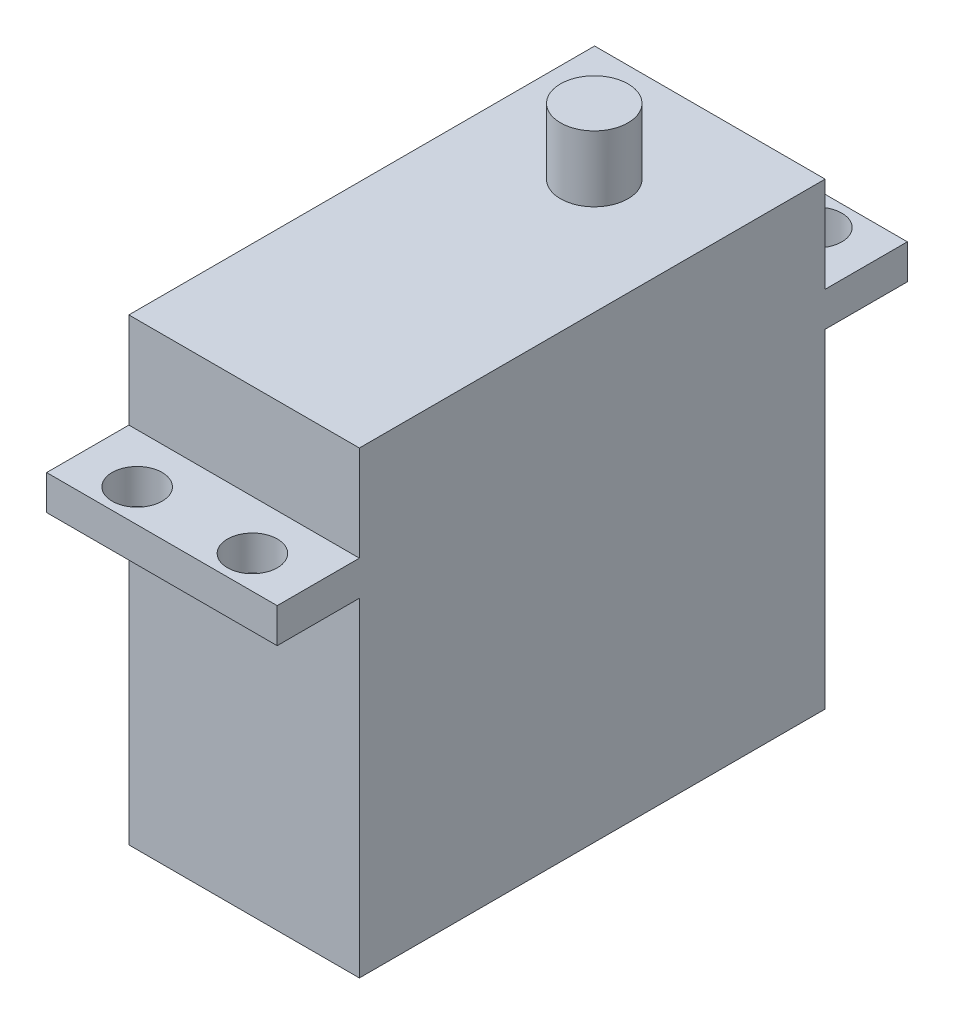
ISO-10303-21;
HEADER;
FILE_DESCRIPTION(('STEP AP214'),'2;1');
FILE_NAME('part.step','',(''),(''),'','','');
FILE_SCHEMA(('AUTOMOTIVE_DESIGN { 1 0 10303 214 1 1 1 1 }'));
ENDSEC;
DATA;
#1=APPLICATION_CONTEXT('core data for automotive mechanical design processes');
#2=APPLICATION_PROTOCOL_DEFINITION('international standard','automotive_design',2000,#1);
#3=PRODUCT_CONTEXT('',#1,'mechanical');
#4=PRODUCT('Part','Part','',(#3));
#5=PRODUCT_RELATED_PRODUCT_CATEGORY('part','',(#4));
#6=PRODUCT_DEFINITION_FORMATION('','',#4);
#7=PRODUCT_DEFINITION_CONTEXT('part definition',#1,'design');
#8=PRODUCT_DEFINITION('design','',#6,#7);
#9=PRODUCT_DEFINITION_SHAPE('','',#8);
#10=(LENGTH_UNIT() NAMED_UNIT(*) SI_UNIT(.MILLI.,.METRE.));
#11=(NAMED_UNIT(*) PLANE_ANGLE_UNIT() SI_UNIT($,.RADIAN.));
#12=(NAMED_UNIT(*) SI_UNIT($,.STERADIAN.) SOLID_ANGLE_UNIT());
#13=UNCERTAINTY_MEASURE_WITH_UNIT(LENGTH_MEASURE(1.E-05),#10,'distance_accuracy_value','');
#14=(GEOMETRIC_REPRESENTATION_CONTEXT(3) GLOBAL_UNCERTAINTY_ASSIGNED_CONTEXT((#13)) GLOBAL_UNIT_ASSIGNED_CONTEXT((#10,
#11,#12)) REPRESENTATION_CONTEXT('',''));
#15=CARTESIAN_POINT('',(0.,0.,0.));
#16=DIRECTION('',(0.,0.,1.));
#17=DIRECTION('',(1.,0.,0.));
#18=AXIS2_PLACEMENT_3D('',#15,#16,#17);
#19=CARTESIAN_POINT('',(-9.9695,39.7002,30.2844));
#20=DIRECTION('',(0.,0.,-1.));
#21=DIRECTION('',(-1.,0.,0.));
#22=AXIS2_PLACEMENT_3D('',#19,#20,#21);
#23=PLANE('',#22);
#24=DIRECTION('',(1.,0.,0.));
#25=VECTOR('',#24,1.);
#26=CARTESIAN_POINT('',(0.,28.448,30.2844));
#27=LINE('',#26,#25);
#28=CARTESIAN_POINT('',(-9.9695,28.448,30.2844));
#29=VERTEX_POINT('',#28);
#30=CARTESIAN_POINT('',(9.9695,28.448,30.2844));
#31=VERTEX_POINT('',#30);
#32=EDGE_CURVE('E444',#29,#31,#27,.T.);
#33=ORIENTED_EDGE('',*,*,#32,.F.);
#34=DIRECTION('',(0.,-1.,0.));
#35=VECTOR('',#34,1.);
#36=CARTESIAN_POINT('',(-9.9695,39.7002,30.2844));
#37=LINE('',#36,#35);
#38=CARTESIAN_POINT('',(-9.9695,0.,30.2844));
#39=VERTEX_POINT('',#38);
#40=EDGE_CURVE('E146',#29,#39,#37,.T.);
#41=ORIENTED_EDGE('',*,*,#40,.T.);
#42=DIRECTION('',(1.,0.,0.));
#43=VECTOR('',#42,1.);
#44=CARTESIAN_POINT('',(-9.9695,0.,30.2844));
#45=LINE('',#44,#43);
#46=CARTESIAN_POINT('',(9.9695,0.,30.2844));
#47=VERTEX_POINT('',#46);
#48=EDGE_CURVE('E198',#39,#47,#45,.T.);
#49=ORIENTED_EDGE('',*,*,#48,.T.);
#50=DIRECTION('',(0.,-1.,0.));
#51=VECTOR('',#50,1.);
#52=CARTESIAN_POINT('',(9.9695,39.7002,30.2844));
#53=LINE('',#52,#51);
#54=EDGE_CURVE('E152',#31,#47,#53,.T.);
#55=ORIENTED_EDGE('',*,*,#54,.F.);
#56=EDGE_LOOP('',(#33,#41,#49,#55));
#57=FACE_BOUND('',#56,.T.);
#58=ADVANCED_FACE('F34',(#57),#23,.F.);
#59=CARTESIAN_POINT('',(-9.9695,39.7002,-10.));
#60=DIRECTION('',(0.,0.,1.));
#61=DIRECTION('',(1.,0.,0.));
#62=AXIS2_PLACEMENT_3D('',#59,#60,#61);
#63=PLANE('',#62);
#64=DIRECTION('',(1.,0.,0.));
#65=VECTOR('',#64,1.);
#66=CARTESIAN_POINT('',(0.,31.448,-10.));
#67=LINE('',#66,#65);
#68=CARTESIAN_POINT('',(-9.9695,31.448,-10.));
#69=VERTEX_POINT('',#68);
#70=CARTESIAN_POINT('',(9.9695,31.448,-10.));
#71=VERTEX_POINT('',#70);
#72=EDGE_CURVE('E472',#69,#71,#67,.T.);
#73=ORIENTED_EDGE('',*,*,#72,.F.);
#74=DIRECTION('',(0.,-1.,0.));
#75=VECTOR('',#74,1.);
#76=CARTESIAN_POINT('',(-9.9695,39.7002,-10.));
#77=LINE('',#76,#75);
#78=CARTESIAN_POINT('',(-9.9695,39.7002,-10.));
#79=VERTEX_POINT('',#78);
#80=EDGE_CURVE('E161',#79,#69,#77,.T.);
#81=ORIENTED_EDGE('',*,*,#80,.F.);
#82=DIRECTION('',(-1.,0.,0.));
#83=VECTOR('',#82,1.);
#84=CARTESIAN_POINT('',(-9.9695,39.7002,-10.));
#85=LINE('',#84,#83);
#86=CARTESIAN_POINT('',(9.9695,39.7002,-10.));
#87=VERTEX_POINT('',#86);
#88=EDGE_CURVE('E211',#87,#79,#85,.T.);
#89=ORIENTED_EDGE('',*,*,#88,.F.);
#90=DIRECTION('',(0.,-1.,0.));
#91=VECTOR('',#90,1.);
#92=CARTESIAN_POINT('',(9.9695,39.7002,-10.));
#93=LINE('',#92,#91);
#94=EDGE_CURVE('E177',#87,#71,#93,.T.);
#95=ORIENTED_EDGE('',*,*,#94,.T.);
#96=EDGE_LOOP('',(#73,#81,#89,#95));
#97=FACE_BOUND('',#96,.T.);
#98=ADVANCED_FACE('F268',(#97),#63,.F.);
#99=CARTESIAN_POINT('',(-9.9695,39.7002,30.2844));
#100=DIRECTION('',(1.,0.,0.));
#101=DIRECTION('',(0.,0.,-1.));
#102=AXIS2_PLACEMENT_3D('',#99,#100,#101);
#103=PLANE('',#102);
#104=DIRECTION('',(0.,0.,1.));
#105=VECTOR('',#104,1.);
#106=CARTESIAN_POINT('',(-9.9695,0.,30.2844));
#107=LINE('',#106,#105);
#108=CARTESIAN_POINT('',(-9.9695,0.,-10.));
#109=VERTEX_POINT('',#108);
#110=EDGE_CURVE('E200',#109,#39,#107,.T.);
#111=ORIENTED_EDGE('',*,*,#110,.T.);
#112=ORIENTED_EDGE('',*,*,#40,.F.);
#113=DIRECTION('',(0.,0.,1.));
#114=VECTOR('',#113,1.);
#115=CARTESIAN_POINT('',(-9.9695,28.448,20.2844));
#116=LINE('',#115,#114);
#117=CARTESIAN_POINT('',(-9.9695,28.448,37.3964));
#118=VERTEX_POINT('',#117);
#119=EDGE_CURVE('E446',#29,#118,#116,.T.);
#120=ORIENTED_EDGE('',*,*,#119,.T.);
#121=DIRECTION('',(0.,-1.,0.));
#122=VECTOR('',#121,1.);
#123=CARTESIAN_POINT('',(-9.9695,31.448,37.3964));
#124=LINE('',#123,#122);
#125=CARTESIAN_POINT('',(-9.9695,31.448,37.3964));
#126=VERTEX_POINT('',#125);
#127=EDGE_CURVE('E133',#126,#118,#124,.T.);
#128=ORIENTED_EDGE('',*,*,#127,.F.);
#129=DIRECTION('',(0.,0.,1.));
#130=VECTOR('',#129,1.);
#131=CARTESIAN_POINT('',(-9.9695,31.448,20.2844));
#132=LINE('',#131,#130);
#133=CARTESIAN_POINT('',(-9.9695,31.448,30.2844));
#134=VERTEX_POINT('',#133);
#135=EDGE_CURVE('E127',#134,#126,#132,.T.);
#136=ORIENTED_EDGE('',*,*,#135,.F.);
#137=CARTESIAN_POINT('',(-9.9695,39.7002,30.2844));
#138=VERTEX_POINT('',#137);
#139=EDGE_CURVE('E43',#138,#134,#37,.T.);
#140=ORIENTED_EDGE('',*,*,#139,.F.);
#141=DIRECTION('',(0.,0.,1.));
#142=VECTOR('',#141,1.);
#143=CARTESIAN_POINT('',(-9.9695,39.7002,30.2844));
#144=LINE('',#143,#142);
#145=EDGE_CURVE('E201',#79,#138,#144,.T.);
#146=ORIENTED_EDGE('',*,*,#145,.F.);
#147=ORIENTED_EDGE('',*,*,#80,.T.);
#148=DIRECTION('',(0.,0.,-1.));
#149=VECTOR('',#148,1.);
#150=CARTESIAN_POINT('',(-9.9695,31.448,0.));
#151=LINE('',#150,#149);
#152=CARTESIAN_POINT('',(-9.9695,31.448,-17.112));
#153=VERTEX_POINT('',#152);
#154=EDGE_CURVE('E243',#69,#153,#151,.T.);
#155=ORIENTED_EDGE('',*,*,#154,.T.);
#156=DIRECTION('',(0.,-1.,0.));
#157=VECTOR('',#156,1.);
#158=CARTESIAN_POINT('',(-9.9695,31.448,-17.112));
#159=LINE('',#158,#157);
#160=CARTESIAN_POINT('',(-9.9695,28.448,-17.112));
#161=VERTEX_POINT('',#160);
#162=EDGE_CURVE('E241',#153,#161,#159,.T.);
#163=ORIENTED_EDGE('',*,*,#162,.T.);
#164=DIRECTION('',(0.,0.,-1.));
#165=VECTOR('',#164,1.);
#166=CARTESIAN_POINT('',(-9.9695,28.448,0.));
#167=LINE('',#166,#165);
#168=CARTESIAN_POINT('',(-9.9695,28.448,-10.));
#169=VERTEX_POINT('',#168);
#170=EDGE_CURVE('E219',#169,#161,#167,.T.);
#171=ORIENTED_EDGE('',*,*,#170,.F.);
#172=EDGE_CURVE('E166',#169,#109,#77,.T.);
#173=ORIENTED_EDGE('',*,*,#172,.T.);
#174=EDGE_LOOP('',(#111,#112,#120,#128,#136,#140,#146,#147,#155,#163,#171,#173));
#175=FACE_BOUND('',#174,.T.);
#176=ADVANCED_FACE('F36',(#175),#103,.F.);
#177=ORIENTED_EDGE('',*,*,#139,.T.);
#178=DIRECTION('',(1.,0.,0.));
#179=VECTOR('',#178,1.);
#180=CARTESIAN_POINT('',(0.,31.448,30.2844));
#181=LINE('',#180,#179);
#182=CARTESIAN_POINT('',(9.9695,31.448,30.2844));
#183=VERTEX_POINT('',#182);
#184=EDGE_CURVE('E135',#134,#183,#181,.T.);
#185=ORIENTED_EDGE('',*,*,#184,.T.);
#186=CARTESIAN_POINT('',(9.9695,39.7002,30.2844));
#187=VERTEX_POINT('',#186);
#188=EDGE_CURVE('E148',#187,#183,#53,.T.);
#189=ORIENTED_EDGE('',*,*,#188,.F.);
#190=DIRECTION('',(1.,0.,0.));
#191=VECTOR('',#190,1.);
#192=CARTESIAN_POINT('',(-9.9695,39.7002,30.2844));
#193=LINE('',#192,#191);
#194=EDGE_CURVE('E144',#138,#187,#193,.T.);
#195=ORIENTED_EDGE('',*,*,#194,.F.);
#196=EDGE_LOOP('',(#177,#185,#189,#195));
#197=FACE_BOUND('',#196,.T.);
#198=ADVANCED_FACE('F143',(#197),#23,.F.);
#199=CARTESIAN_POINT('',(9.9695,39.7002,30.2844));
#200=DIRECTION('',(-1.,0.,0.));
#201=DIRECTION('',(0.,0.,1.));
#202=AXIS2_PLACEMENT_3D('',#199,#200,#201);
#203=PLANE('',#202);
#204=DIRECTION('',(0.,0.,-1.));
#205=VECTOR('',#204,1.);
#206=CARTESIAN_POINT('',(9.9695,0.,30.2844));
#207=LINE('',#206,#205);
#208=CARTESIAN_POINT('',(9.9695,0.,-10.));
#209=VERTEX_POINT('',#208);
#210=EDGE_CURVE('E191',#47,#209,#207,.T.);
#211=ORIENTED_EDGE('',*,*,#210,.T.);
#212=CARTESIAN_POINT('',(9.9695,28.448,-10.));
#213=VERTEX_POINT('',#212);
#214=EDGE_CURVE('E165',#213,#209,#93,.T.);
#215=ORIENTED_EDGE('',*,*,#214,.F.);
#216=DIRECTION('',(0.,0.,-1.));
#217=VECTOR('',#216,1.);
#218=CARTESIAN_POINT('',(9.9695,28.448,0.));
#219=LINE('',#218,#217);
#220=CARTESIAN_POINT('',(9.9695,28.448,-17.112));
#221=VERTEX_POINT('',#220);
#222=EDGE_CURVE('E223',#213,#221,#219,.T.);
#223=ORIENTED_EDGE('',*,*,#222,.T.);
#224=DIRECTION('',(0.,-1.,0.));
#225=VECTOR('',#224,1.);
#226=CARTESIAN_POINT('',(9.9695,31.448,-17.112));
#227=LINE('',#226,#225);
#228=CARTESIAN_POINT('',(9.9695,31.448,-17.112));
#229=VERTEX_POINT('',#228);
#230=EDGE_CURVE('E242',#229,#221,#227,.T.);
#231=ORIENTED_EDGE('',*,*,#230,.F.);
#232=DIRECTION('',(0.,0.,-1.));
#233=VECTOR('',#232,1.);
#234=CARTESIAN_POINT('',(9.9695,31.448,0.));
#235=LINE('',#234,#233);
#236=EDGE_CURVE('E479',#71,#229,#235,.T.);
#237=ORIENTED_EDGE('',*,*,#236,.F.);
#238=ORIENTED_EDGE('',*,*,#94,.F.);
#239=DIRECTION('',(0.,0.,-1.));
#240=VECTOR('',#239,1.);
#241=CARTESIAN_POINT('',(9.9695,39.7002,30.2844));
#242=LINE('',#241,#240);
#243=EDGE_CURVE('E204',#187,#87,#242,.T.);
#244=ORIENTED_EDGE('',*,*,#243,.F.);
#245=ORIENTED_EDGE('',*,*,#188,.T.);
#246=DIRECTION('',(0.,0.,1.));
#247=VECTOR('',#246,1.);
#248=CARTESIAN_POINT('',(9.9695,31.448,20.2844));
#249=LINE('',#248,#247);
#250=CARTESIAN_POINT('',(9.9695,31.448,37.3964));
#251=VERTEX_POINT('',#250);
#252=EDGE_CURVE('E51',#183,#251,#249,.T.);
#253=ORIENTED_EDGE('',*,*,#252,.T.);
#254=DIRECTION('',(0.,-1.,0.));
#255=VECTOR('',#254,1.);
#256=CARTESIAN_POINT('',(9.9695,31.448,37.3964));
#257=LINE('',#256,#255);
#258=CARTESIAN_POINT('',(9.9695,28.448,37.3964));
#259=VERTEX_POINT('',#258);
#260=EDGE_CURVE('E449',#251,#259,#257,.T.);
#261=ORIENTED_EDGE('',*,*,#260,.T.);
#262=DIRECTION('',(0.,0.,1.));
#263=VECTOR('',#262,1.);
#264=CARTESIAN_POINT('',(9.9695,28.448,20.2844));
#265=LINE('',#264,#263);
#266=EDGE_CURVE('E445',#31,#259,#265,.T.);
#267=ORIENTED_EDGE('',*,*,#266,.F.);
#268=ORIENTED_EDGE('',*,*,#54,.T.);
#269=EDGE_LOOP('',(#211,#215,#223,#231,#237,#238,#244,#245,#253,#261,#267,#268));
#270=FACE_BOUND('',#269,.T.);
#271=ADVANCED_FACE('F192',(#270),#203,.F.);
#272=ORIENTED_EDGE('',*,*,#172,.F.);
#273=DIRECTION('',(1.,0.,0.));
#274=VECTOR('',#273,1.);
#275=CARTESIAN_POINT('',(0.,28.448,-10.));
#276=LINE('',#275,#274);
#277=EDGE_CURVE('E59',#169,#213,#276,.T.);
#278=ORIENTED_EDGE('',*,*,#277,.T.);
#279=ORIENTED_EDGE('',*,*,#214,.T.);
#280=DIRECTION('',(-1.,0.,0.));
#281=VECTOR('',#280,1.);
#282=CARTESIAN_POINT('',(-9.9695,0.,-10.));
#283=LINE('',#282,#281);
#284=EDGE_CURVE('E170',#209,#109,#283,.T.);
#285=ORIENTED_EDGE('',*,*,#284,.T.);
#286=EDGE_LOOP('',(#272,#278,#279,#285));
#287=FACE_BOUND('',#286,.T.);
#288=ADVANCED_FACE('F184',(#287),#63,.F.);
#289=CARTESIAN_POINT('',(0.,39.7002,0.));
#290=DIRECTION('',(0.,-1.,0.));
#291=DIRECTION('',(0.,0.,-1.));
#292=AXIS2_PLACEMENT_3D('',#289,#290,#291);
#293=PLANE('',#292);
#294=CARTESIAN_POINT('',(0.,39.7002,0.));
#295=DIRECTION('',(0.,-1.,0.));
#296=DIRECTION('',(0.,0.,-1.));
#297=AXIS2_PLACEMENT_3D('',#294,#295,#296);
#298=CIRCLE('',#297,2.921);
#299=CARTESIAN_POINT('',(0.,39.7002,-2.921));
#300=VERTEX_POINT('',#299);
#301=EDGE_CURVE('E11',#300,#300,#298,.F.);
#302=ORIENTED_EDGE('',*,*,#301,.F.);
#303=EDGE_LOOP('',(#302));
#304=FACE_BOUND('',#303,.T.);
#305=ORIENTED_EDGE('',*,*,#145,.T.);
#306=ORIENTED_EDGE('',*,*,#194,.T.);
#307=ORIENTED_EDGE('',*,*,#243,.T.);
#308=ORIENTED_EDGE('',*,*,#88,.T.);
#309=EDGE_LOOP('',(#305,#306,#307,#308));
#310=FACE_BOUND('',#309,.T.);
#311=ADVANCED_FACE('F259',(#304,#310),#293,.F.);
#312=CARTESIAN_POINT('',(0.,0.,0.));
#313=DIRECTION('',(0.,-1.,0.));
#314=DIRECTION('',(0.,0.,-1.));
#315=AXIS2_PLACEMENT_3D('',#312,#313,#314);
#316=PLANE('',#315);
#317=ORIENTED_EDGE('',*,*,#110,.F.);
#318=ORIENTED_EDGE('',*,*,#284,.F.);
#319=ORIENTED_EDGE('',*,*,#210,.F.);
#320=ORIENTED_EDGE('',*,*,#48,.F.);
#321=EDGE_LOOP('',(#317,#318,#319,#320));
#322=FACE_BOUND('',#321,.T.);
#323=ADVANCED_FACE('F199',(#322),#316,.T.);
#324=CARTESIAN_POINT('',(0.,45.3898,0.));
#325=DIRECTION('',(0.,-1.,0.));
#326=DIRECTION('',(0.,0.,-1.));
#327=AXIS2_PLACEMENT_3D('',#324,#325,#326);
#328=CYLINDRICAL_SURFACE('',#327,2.921);
#329=CARTESIAN_POINT('',(0.,45.3898,0.));
#330=DIRECTION('',(0.,1.,0.));
#331=DIRECTION('',(0.,0.,1.));
#332=AXIS2_PLACEMENT_3D('',#329,#330,#331);
#333=CIRCLE('',#332,2.921);
#334=CARTESIAN_POINT('',(0.,45.3898,2.921));
#335=VERTEX_POINT('',#334);
#336=EDGE_CURVE('E207',#335,#335,#333,.T.);
#337=ORIENTED_EDGE('',*,*,#336,.F.);
#338=EDGE_LOOP('',(#337));
#339=FACE_BOUND('',#338,.T.);
#340=ORIENTED_EDGE('',*,*,#301,.T.);
#341=EDGE_LOOP('',(#340));
#342=FACE_BOUND('',#341,.T.);
#343=ADVANCED_FACE('F253',(#339,#342),#328,.T.);
#344=CARTESIAN_POINT('',(0.,45.3898,0.));
#345=DIRECTION('',(0.,1.,0.));
#346=DIRECTION('',(0.,0.,1.));
#347=AXIS2_PLACEMENT_3D('',#344,#345,#346);
#348=PLANE('',#347);
#349=ORIENTED_EDGE('',*,*,#336,.T.);
#350=EDGE_LOOP('',(#349));
#351=FACE_BOUND('',#350,.T.);
#352=ADVANCED_FACE('F251',(#351),#348,.T.);
#353=CARTESIAN_POINT('',(0.,31.448,-17.112));
#354=DIRECTION('',(0.,0.,-1.));
#355=DIRECTION('',(-1.,0.,0.));
#356=AXIS2_PLACEMENT_3D('',#353,#354,#355);
#357=PLANE('',#356);
#358=DIRECTION('',(1.,0.,0.));
#359=VECTOR('',#358,1.);
#360=CARTESIAN_POINT('',(0.,28.448,-17.112));
#361=LINE('',#360,#359);
#362=EDGE_CURVE('E226',#161,#221,#361,.T.);
#363=ORIENTED_EDGE('',*,*,#362,.F.);
#364=ORIENTED_EDGE('',*,*,#162,.F.);
#365=DIRECTION('',(1.,0.,0.));
#366=VECTOR('',#365,1.);
#367=CARTESIAN_POINT('',(0.,31.448,-17.112));
#368=LINE('',#367,#366);
#369=EDGE_CURVE('E475',#153,#229,#368,.T.);
#370=ORIENTED_EDGE('',*,*,#369,.T.);
#371=ORIENTED_EDGE('',*,*,#230,.T.);
#372=EDGE_LOOP('',(#363,#364,#370,#371));
#373=FACE_BOUND('',#372,.T.);
#374=ADVANCED_FACE('F304',(#373),#357,.T.);
#375=CARTESIAN_POINT('',(-4.98475,31.448,-14.2672));
#376=DIRECTION('',(0.,-1.,0.));
#377=DIRECTION('',(0.,0.,-1.));
#378=AXIS2_PLACEMENT_3D('',#375,#376,#377);
#379=CYLINDRICAL_SURFACE('',#378,2.159);
#380=CARTESIAN_POINT('',(-4.98475,31.448,-14.2672));
#381=DIRECTION('',(0.,1.,0.));
#382=DIRECTION('',(0.,0.,1.));
#383=AXIS2_PLACEMENT_3D('',#380,#381,#382);
#384=CIRCLE('',#383,2.159);
#385=CARTESIAN_POINT('',(-4.98475,31.448,-12.1082));
#386=VERTEX_POINT('',#385);
#387=EDGE_CURVE('E469',#386,#386,#384,.T.);
#388=ORIENTED_EDGE('',*,*,#387,.T.);
#389=EDGE_LOOP('',(#388));
#390=FACE_BOUND('',#389,.T.);
#391=CARTESIAN_POINT('',(-4.98475,28.448,-14.2672));
#392=DIRECTION('',(0.,1.,0.));
#393=DIRECTION('',(0.,0.,1.));
#394=AXIS2_PLACEMENT_3D('',#391,#392,#393);
#395=CIRCLE('',#394,2.159);
#396=CARTESIAN_POINT('',(-4.98475,28.448,-12.1082));
#397=VERTEX_POINT('',#396);
#398=EDGE_CURVE('E224',#397,#397,#395,.T.);
#399=ORIENTED_EDGE('',*,*,#398,.F.);
#400=EDGE_LOOP('',(#399));
#401=FACE_BOUND('',#400,.T.);
#402=ADVANCED_FACE('F309',(#390,#401),#379,.F.);
#403=CARTESIAN_POINT('',(4.98475,31.448,-14.2672));
#404=DIRECTION('',(0.,-1.,0.));
#405=DIRECTION('',(0.,0.,-1.));
#406=AXIS2_PLACEMENT_3D('',#403,#404,#405);
#407=CYLINDRICAL_SURFACE('',#406,2.159);
#408=CARTESIAN_POINT('',(4.98475,31.448,-14.2672));
#409=DIRECTION('',(0.,1.,0.));
#410=DIRECTION('',(0.,0.,1.));
#411=AXIS2_PLACEMENT_3D('',#408,#409,#410);
#412=CIRCLE('',#411,2.159);
#413=CARTESIAN_POINT('',(4.98475,31.448,-12.1082));
#414=VERTEX_POINT('',#413);
#415=EDGE_CURVE('E466',#414,#414,#412,.T.);
#416=ORIENTED_EDGE('',*,*,#415,.T.);
#417=EDGE_LOOP('',(#416));
#418=FACE_BOUND('',#417,.T.);
#419=CARTESIAN_POINT('',(4.98475,28.448,-14.2672));
#420=DIRECTION('',(0.,1.,0.));
#421=DIRECTION('',(0.,0.,1.));
#422=AXIS2_PLACEMENT_3D('',#419,#420,#421);
#423=CIRCLE('',#422,2.159);
#424=CARTESIAN_POINT('',(4.98475,28.448,-12.1082));
#425=VERTEX_POINT('',#424);
#426=EDGE_CURVE('E229',#425,#425,#423,.T.);
#427=ORIENTED_EDGE('',*,*,#426,.F.);
#428=EDGE_LOOP('',(#427));
#429=FACE_BOUND('',#428,.T.);
#430=ADVANCED_FACE('F319',(#418,#429),#407,.F.);
#431=CARTESIAN_POINT('',(0.,31.448,0.));
#432=DIRECTION('',(0.,1.,0.));
#433=DIRECTION('',(0.,0.,1.));
#434=AXIS2_PLACEMENT_3D('',#431,#432,#433);
#435=PLANE('',#434);
#436=ORIENTED_EDGE('',*,*,#415,.F.);
#437=EDGE_LOOP('',(#436));
#438=FACE_BOUND('',#437,.T.);
#439=ORIENTED_EDGE('',*,*,#387,.F.);
#440=EDGE_LOOP('',(#439));
#441=FACE_BOUND('',#440,.T.);
#442=ORIENTED_EDGE('',*,*,#72,.T.);
#443=ORIENTED_EDGE('',*,*,#236,.T.);
#444=ORIENTED_EDGE('',*,*,#369,.F.);
#445=ORIENTED_EDGE('',*,*,#154,.F.);
#446=EDGE_LOOP('',(#442,#443,#444,#445));
#447=FACE_BOUND('',#446,.T.);
#448=ADVANCED_FACE('F329',(#438,#441,#447),#435,.T.);
#449=CARTESIAN_POINT('',(0.,28.448,0.));
#450=DIRECTION('',(0.,1.,0.));
#451=DIRECTION('',(0.,0.,1.));
#452=AXIS2_PLACEMENT_3D('',#449,#450,#451);
#453=PLANE('',#452);
#454=ORIENTED_EDGE('',*,*,#426,.T.);
#455=EDGE_LOOP('',(#454));
#456=FACE_BOUND('',#455,.T.);
#457=ORIENTED_EDGE('',*,*,#398,.T.);
#458=EDGE_LOOP('',(#457));
#459=FACE_BOUND('',#458,.T.);
#460=ORIENTED_EDGE('',*,*,#277,.F.);
#461=ORIENTED_EDGE('',*,*,#170,.T.);
#462=ORIENTED_EDGE('',*,*,#362,.T.);
#463=ORIENTED_EDGE('',*,*,#222,.F.);
#464=EDGE_LOOP('',(#460,#461,#462,#463));
#465=FACE_BOUND('',#464,.T.);
#466=ADVANCED_FACE('F221',(#456,#459,#465),#453,.F.);
#467=CARTESIAN_POINT('',(0.,31.448,37.3964));
#468=DIRECTION('',(0.,0.,-1.));
#469=DIRECTION('',(-1.,0.,0.));
#470=AXIS2_PLACEMENT_3D('',#467,#468,#469);
#471=PLANE('',#470);
#472=DIRECTION('',(1.,0.,0.));
#473=VECTOR('',#472,1.);
#474=CARTESIAN_POINT('',(0.,28.448,37.3964));
#475=LINE('',#474,#473);
#476=EDGE_CURVE('E452',#118,#259,#475,.T.);
#477=ORIENTED_EDGE('',*,*,#476,.T.);
#478=ORIENTED_EDGE('',*,*,#260,.F.);
#479=DIRECTION('',(1.,0.,0.));
#480=VECTOR('',#479,1.);
#481=CARTESIAN_POINT('',(0.,31.448,37.3964));
#482=LINE('',#481,#480);
#483=EDGE_CURVE('E134',#126,#251,#482,.T.);
#484=ORIENTED_EDGE('',*,*,#483,.F.);
#485=ORIENTED_EDGE('',*,*,#127,.T.);
#486=EDGE_LOOP('',(#477,#478,#484,#485));
#487=FACE_BOUND('',#486,.T.);
#488=ADVANCED_FACE('F347',(#487),#471,.F.);
#489=CARTESIAN_POINT('',(-4.98475,31.448,34.5516));
#490=DIRECTION('',(0.,-1.,0.));
#491=DIRECTION('',(0.,0.,-1.));
#492=AXIS2_PLACEMENT_3D('',#489,#490,#491);
#493=CYLINDRICAL_SURFACE('',#492,2.159);
#494=CARTESIAN_POINT('',(-4.98475,31.448,34.5516));
#495=DIRECTION('',(0.,-1.,0.));
#496=DIRECTION('',(0.,0.,-1.));
#497=AXIS2_PLACEMENT_3D('',#494,#495,#496);
#498=CIRCLE('',#497,2.159);
#499=CARTESIAN_POINT('',(-4.98475,31.448,32.3926));
#500=VERTEX_POINT('',#499);
#501=EDGE_CURVE('E141',#500,#500,#498,.T.);
#502=ORIENTED_EDGE('',*,*,#501,.F.);
#503=EDGE_LOOP('',(#502));
#504=FACE_BOUND('',#503,.T.);
#505=CARTESIAN_POINT('',(-4.98475,28.448,34.5516));
#506=DIRECTION('',(0.,-1.,0.));
#507=DIRECTION('',(0.,0.,-1.));
#508=AXIS2_PLACEMENT_3D('',#505,#506,#507);
#509=CIRCLE('',#508,2.159);
#510=CARTESIAN_POINT('',(-4.98475,28.448,32.3926));
#511=VERTEX_POINT('',#510);
#512=EDGE_CURVE('E442',#511,#511,#509,.T.);
#513=ORIENTED_EDGE('',*,*,#512,.T.);
#514=EDGE_LOOP('',(#513));
#515=FACE_BOUND('',#514,.T.);
#516=ADVANCED_FACE('F375',(#504,#515),#493,.F.);
#517=CARTESIAN_POINT('',(4.98475,31.448,34.5516));
#518=DIRECTION('',(0.,-1.,0.));
#519=DIRECTION('',(0.,0.,-1.));
#520=AXIS2_PLACEMENT_3D('',#517,#518,#519);
#521=CYLINDRICAL_SURFACE('',#520,2.159);
#522=CARTESIAN_POINT('',(4.98475,31.448,34.5516));
#523=DIRECTION('',(0.,-1.,0.));
#524=DIRECTION('',(0.,0.,-1.));
#525=AXIS2_PLACEMENT_3D('',#522,#523,#524);
#526=CIRCLE('',#525,2.159);
#527=CARTESIAN_POINT('',(4.98475,31.448,32.3926));
#528=VERTEX_POINT('',#527);
#529=EDGE_CURVE('E451',#528,#528,#526,.T.);
#530=ORIENTED_EDGE('',*,*,#529,.F.);
#531=EDGE_LOOP('',(#530));
#532=FACE_BOUND('',#531,.T.);
#533=CARTESIAN_POINT('',(4.98475,28.448,34.5516));
#534=DIRECTION('',(0.,-1.,0.));
#535=DIRECTION('',(0.,0.,-1.));
#536=AXIS2_PLACEMENT_3D('',#533,#534,#535);
#537=CIRCLE('',#536,2.159);
#538=CARTESIAN_POINT('',(4.98475,28.448,32.3926));
#539=VERTEX_POINT('',#538);
#540=EDGE_CURVE('E438',#539,#539,#537,.T.);
#541=ORIENTED_EDGE('',*,*,#540,.T.);
#542=EDGE_LOOP('',(#541));
#543=FACE_BOUND('',#542,.T.);
#544=ADVANCED_FACE('F384',(#532,#543),#521,.F.);
#545=CARTESIAN_POINT('',(0.,31.448,20.2844));
#546=DIRECTION('',(0.,1.,0.));
#547=DIRECTION('',(0.,0.,-1.));
#548=AXIS2_PLACEMENT_3D('',#545,#546,#547);
#549=PLANE('',#548);
#550=ORIENTED_EDGE('',*,*,#529,.T.);
#551=EDGE_LOOP('',(#550));
#552=FACE_BOUND('',#551,.T.);
#553=ORIENTED_EDGE('',*,*,#501,.T.);
#554=EDGE_LOOP('',(#553));
#555=FACE_BOUND('',#554,.T.);
#556=ORIENTED_EDGE('',*,*,#184,.F.);
#557=ORIENTED_EDGE('',*,*,#135,.T.);
#558=ORIENTED_EDGE('',*,*,#483,.T.);
#559=ORIENTED_EDGE('',*,*,#252,.F.);
#560=EDGE_LOOP('',(#556,#557,#558,#559));
#561=FACE_BOUND('',#560,.T.);
#562=ADVANCED_FACE('F137',(#552,#555,#561),#549,.T.);
#563=CARTESIAN_POINT('',(0.,28.448,20.2844));
#564=DIRECTION('',(0.,1.,0.));
#565=DIRECTION('',(0.,0.,-1.));
#566=AXIS2_PLACEMENT_3D('',#563,#564,#565);
#567=PLANE('',#566);
#568=ORIENTED_EDGE('',*,*,#540,.F.);
#569=EDGE_LOOP('',(#568));
#570=FACE_BOUND('',#569,.T.);
#571=ORIENTED_EDGE('',*,*,#512,.F.);
#572=EDGE_LOOP('',(#571));
#573=FACE_BOUND('',#572,.T.);
#574=ORIENTED_EDGE('',*,*,#32,.T.);
#575=ORIENTED_EDGE('',*,*,#266,.T.);
#576=ORIENTED_EDGE('',*,*,#476,.F.);
#577=ORIENTED_EDGE('',*,*,#119,.F.);
#578=EDGE_LOOP('',(#574,#575,#576,#577));
#579=FACE_BOUND('',#578,.T.);
#580=ADVANCED_FACE('F401',(#570,#573,#579),#567,.F.);
#581=CLOSED_SHELL('',(#58,#98,#176,#198,#271,#288,#311,#323,#343,#352,#374,#402,#430,#448,#466,
#488,#516,#544,#562,#580));
#582=MANIFOLD_SOLID_BREP('B2',#581);
#583=ADVANCED_BREP_SHAPE_REPRESENTATION('',(#18,#582),#14);
#584=SHAPE_DEFINITION_REPRESENTATION(#9,#583);
ENDSEC;
END-ISO-10303-21;
